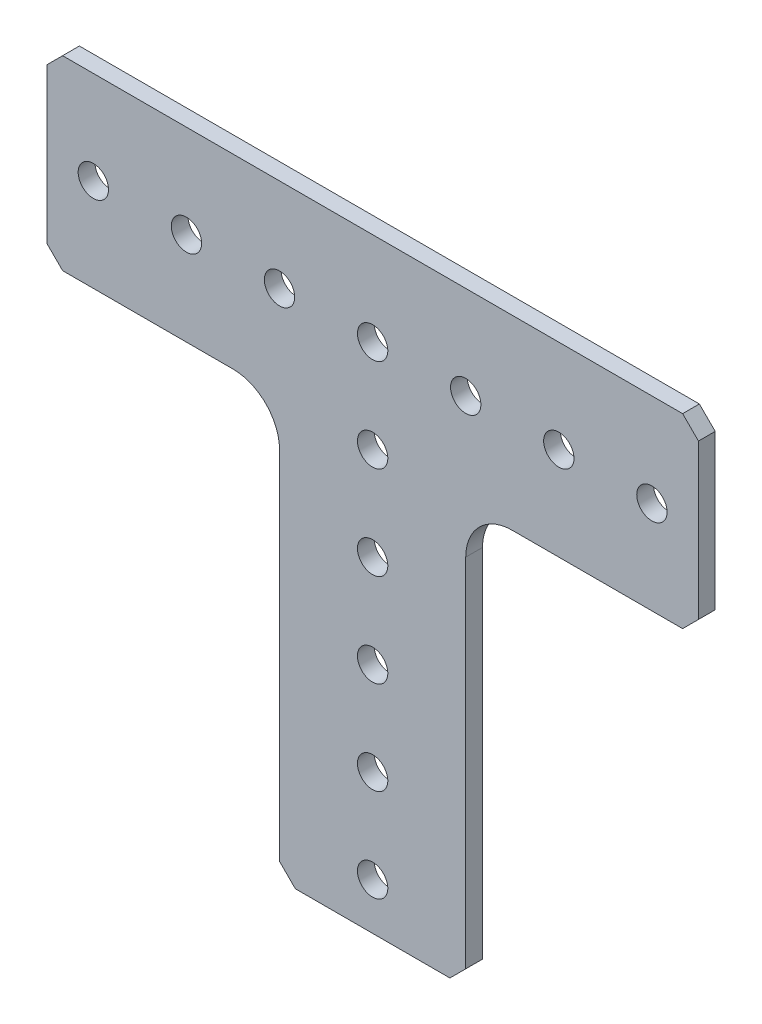
ISO-10303-21;
HEADER;
FILE_DESCRIPTION(('STEP AP214'),'2;1');
FILE_NAME('part.step','',(''),(''),'','','');
FILE_SCHEMA(('AUTOMOTIVE_DESIGN { 1 0 10303 214 1 1 1 1 }'));
ENDSEC;
DATA;
#1=APPLICATION_CONTEXT('core data for automotive mechanical design processes');
#2=APPLICATION_PROTOCOL_DEFINITION('international standard','automotive_design',2000,#1);
#3=PRODUCT_CONTEXT('',#1,'mechanical');
#4=PRODUCT('Part','Part','',(#3));
#5=PRODUCT_RELATED_PRODUCT_CATEGORY('part','',(#4));
#6=PRODUCT_DEFINITION_FORMATION('','',#4);
#7=PRODUCT_DEFINITION_CONTEXT('part definition',#1,'design');
#8=PRODUCT_DEFINITION('design','',#6,#7);
#9=PRODUCT_DEFINITION_SHAPE('','',#8);
#10=(LENGTH_UNIT() NAMED_UNIT(*) SI_UNIT(.MILLI.,.METRE.));
#11=(NAMED_UNIT(*) PLANE_ANGLE_UNIT() SI_UNIT($,.RADIAN.));
#12=(NAMED_UNIT(*) SI_UNIT($,.STERADIAN.) SOLID_ANGLE_UNIT());
#13=UNCERTAINTY_MEASURE_WITH_UNIT(LENGTH_MEASURE(1.E-05),#10,'distance_accuracy_value','');
#14=(GEOMETRIC_REPRESENTATION_CONTEXT(3) GLOBAL_UNCERTAINTY_ASSIGNED_CONTEXT((#13)) GLOBAL_UNIT_ASSIGNED_CONTEXT((#10,
#11,#12)) REPRESENTATION_CONTEXT('',''));
#15=CARTESIAN_POINT('',(0.,0.,0.));
#16=DIRECTION('',(0.,0.,1.));
#17=DIRECTION('',(1.,0.,0.));
#18=AXIS2_PLACEMENT_3D('',#15,#16,#17);
#19=CARTESIAN_POINT('',(44.45,-57.15,2.286));
#20=DIRECTION('',(0.,0.,1.));
#21=DIRECTION('',(1.,0.,0.));
#22=AXIS2_PLACEMENT_3D('',#19,#20,#21);
#23=PLANE('',#22);
#24=CARTESIAN_POINT('',(0.,-38.1,2.286));
#25=DIRECTION('',(0.,0.,-1.));
#26=DIRECTION('',(-1.,0.,0.));
#27=AXIS2_PLACEMENT_3D('',#24,#25,#26);
#28=CIRCLE('',#27,2.0701);
#29=CARTESIAN_POINT('',(-2.0701,-38.1,2.286));
#30=VERTEX_POINT('',#29);
#31=EDGE_CURVE('E221',#30,#30,#28,.T.);
#32=ORIENTED_EDGE('',*,*,#31,.T.);
#33=EDGE_LOOP('',(#32));
#34=FACE_BOUND('',#33,.T.);
#35=CARTESIAN_POINT('',(0.,-12.7,2.286));
#36=DIRECTION('',(0.,0.,-1.));
#37=DIRECTION('',(-1.,0.,0.));
#38=AXIS2_PLACEMENT_3D('',#35,#36,#37);
#39=CIRCLE('',#38,2.0701);
#40=CARTESIAN_POINT('',(-2.0701,-12.7,2.286));
#41=VERTEX_POINT('',#40);
#42=EDGE_CURVE('E320',#41,#41,#39,.T.);
#43=ORIENTED_EDGE('',*,*,#42,.T.);
#44=EDGE_LOOP('',(#43));
#45=FACE_BOUND('',#44,.T.);
#46=CARTESIAN_POINT('',(38.1,12.7,2.286));
#47=DIRECTION('',(0.,0.,-1.));
#48=DIRECTION('',(-1.,0.,0.));
#49=AXIS2_PLACEMENT_3D('',#46,#47,#48);
#50=CIRCLE('',#49,2.0701);
#51=CARTESIAN_POINT('',(36.0299,12.7,2.286));
#52=VERTEX_POINT('',#51);
#53=EDGE_CURVE('E323',#52,#52,#50,.T.);
#54=ORIENTED_EDGE('',*,*,#53,.T.);
#55=EDGE_LOOP('',(#54));
#56=FACE_BOUND('',#55,.T.);
#57=CARTESIAN_POINT('',(12.7,12.7,2.286));
#58=DIRECTION('',(0.,0.,-1.));
#59=DIRECTION('',(-1.,0.,0.));
#60=AXIS2_PLACEMENT_3D('',#57,#58,#59);
#61=CIRCLE('',#60,2.0701);
#62=CARTESIAN_POINT('',(10.6299,12.7,2.286));
#63=VERTEX_POINT('',#62);
#64=EDGE_CURVE('E326',#63,#63,#61,.T.);
#65=ORIENTED_EDGE('',*,*,#64,.T.);
#66=EDGE_LOOP('',(#65));
#67=FACE_BOUND('',#66,.T.);
#68=CARTESIAN_POINT('',(-12.7,12.7,2.286));
#69=DIRECTION('',(0.,0.,-1.));
#70=DIRECTION('',(-1.,0.,0.));
#71=AXIS2_PLACEMENT_3D('',#68,#69,#70);
#72=CIRCLE('',#71,2.0701);
#73=CARTESIAN_POINT('',(-14.7701,12.7,2.286));
#74=VERTEX_POINT('',#73);
#75=EDGE_CURVE('E329',#74,#74,#72,.T.);
#76=ORIENTED_EDGE('',*,*,#75,.T.);
#77=EDGE_LOOP('',(#76));
#78=FACE_BOUND('',#77,.T.);
#79=CARTESIAN_POINT('',(-38.1,12.7,2.286));
#80=DIRECTION('',(0.,0.,-1.));
#81=DIRECTION('',(-1.,0.,0.));
#82=AXIS2_PLACEMENT_3D('',#79,#80,#81);
#83=CIRCLE('',#82,2.0701);
#84=CARTESIAN_POINT('',(-40.1701,12.7,2.286));
#85=VERTEX_POINT('',#84);
#86=EDGE_CURVE('E332',#85,#85,#83,.T.);
#87=ORIENTED_EDGE('',*,*,#86,.T.);
#88=EDGE_LOOP('',(#87));
#89=FACE_BOUND('',#88,.T.);
#90=CARTESIAN_POINT('',(-25.4,12.7,2.286));
#91=DIRECTION('',(0.,0.,-1.));
#92=DIRECTION('',(-1.,0.,0.));
#93=AXIS2_PLACEMENT_3D('',#90,#91,#92);
#94=CIRCLE('',#93,2.0701);
#95=CARTESIAN_POINT('',(-27.4701,12.7,2.286));
#96=VERTEX_POINT('',#95);
#97=EDGE_CURVE('E335',#96,#96,#94,.T.);
#98=ORIENTED_EDGE('',*,*,#97,.T.);
#99=EDGE_LOOP('',(#98));
#100=FACE_BOUND('',#99,.T.);
#101=CARTESIAN_POINT('',(0.,12.7,2.286));
#102=DIRECTION('',(0.,0.,-1.));
#103=DIRECTION('',(-1.,0.,0.));
#104=AXIS2_PLACEMENT_3D('',#101,#102,#103);
#105=CIRCLE('',#104,2.0701);
#106=CARTESIAN_POINT('',(-2.0701,12.7,2.286));
#107=VERTEX_POINT('',#106);
#108=EDGE_CURVE('E338',#107,#107,#105,.T.);
#109=ORIENTED_EDGE('',*,*,#108,.T.);
#110=EDGE_LOOP('',(#109));
#111=FACE_BOUND('',#110,.T.);
#112=CARTESIAN_POINT('',(25.4,12.7,2.286));
#113=DIRECTION('',(0.,0.,-1.));
#114=DIRECTION('',(-1.,0.,0.));
#115=AXIS2_PLACEMENT_3D('',#112,#113,#114);
#116=CIRCLE('',#115,2.0701);
#117=CARTESIAN_POINT('',(23.3299,12.7,2.286));
#118=VERTEX_POINT('',#117);
#119=EDGE_CURVE('E341',#118,#118,#116,.T.);
#120=ORIENTED_EDGE('',*,*,#119,.T.);
#121=EDGE_LOOP('',(#120));
#122=FACE_BOUND('',#121,.T.);
#123=CARTESIAN_POINT('',(0.,0.,2.286));
#124=DIRECTION('',(0.,0.,-1.));
#125=DIRECTION('',(-1.,0.,0.));
#126=AXIS2_PLACEMENT_3D('',#123,#124,#125);
#127=CIRCLE('',#126,2.0701);
#128=CARTESIAN_POINT('',(-2.0701,0.,2.286));
#129=VERTEX_POINT('',#128);
#130=EDGE_CURVE('E344',#129,#129,#127,.T.);
#131=ORIENTED_EDGE('',*,*,#130,.T.);
#132=EDGE_LOOP('',(#131));
#133=FACE_BOUND('',#132,.T.);
#134=CARTESIAN_POINT('',(0.,-25.4,2.286));
#135=DIRECTION('',(0.,0.,-1.));
#136=DIRECTION('',(-1.,0.,0.));
#137=AXIS2_PLACEMENT_3D('',#134,#135,#136);
#138=CIRCLE('',#137,2.0701);
#139=CARTESIAN_POINT('',(-2.0701,-25.4,2.286));
#140=VERTEX_POINT('',#139);
#141=EDGE_CURVE('E346',#140,#140,#138,.T.);
#142=ORIENTED_EDGE('',*,*,#141,.T.);
#143=EDGE_LOOP('',(#142));
#144=FACE_BOUND('',#143,.T.);
#145=CARTESIAN_POINT('',(0.,-50.8,2.286));
#146=DIRECTION('',(0.,0.,-1.));
#147=DIRECTION('',(-1.,0.,0.));
#148=AXIS2_PLACEMENT_3D('',#145,#146,#147);
#149=CIRCLE('',#148,2.0701);
#150=CARTESIAN_POINT('',(-2.07009999999999,-50.8,2.286));
#151=VERTEX_POINT('',#150);
#152=EDGE_CURVE('E19',#151,#151,#149,.T.);
#153=ORIENTED_EDGE('',*,*,#152,.T.);
#154=EDGE_LOOP('',(#153));
#155=FACE_BOUND('',#154,.T.);
#156=DIRECTION('',(0.,1.,0.));
#157=VECTOR('',#156,1.);
#158=CARTESIAN_POINT('',(12.7,0.,2.286));
#159=LINE('',#158,#157);
#160=CARTESIAN_POINT('',(12.7,-54.991,2.286));
#161=VERTEX_POINT('',#160);
#162=CARTESIAN_POINT('',(12.7,-6.34999999999998,2.286));
#163=VERTEX_POINT('',#162);
#164=EDGE_CURVE('E239',#161,#163,#159,.T.);
#165=ORIENTED_EDGE('',*,*,#164,.T.);
#166=CARTESIAN_POINT('',(19.05,-6.34999999999998,2.286));
#167=DIRECTION('',(0.,0.,1.));
#168=DIRECTION('',(1.,0.,0.));
#169=AXIS2_PLACEMENT_3D('',#166,#167,#168);
#170=CIRCLE('',#169,6.35000000000001);
#171=CARTESIAN_POINT('',(19.05,0.,2.286));
#172=VERTEX_POINT('',#171);
#173=EDGE_CURVE('E316',#163,#172,#170,.F.);
#174=ORIENTED_EDGE('',*,*,#173,.T.);
#175=DIRECTION('',(-1.,0.,0.));
#176=VECTOR('',#175,1.);
#177=CARTESIAN_POINT('',(0.,0.,2.286));
#178=LINE('',#177,#176);
#179=CARTESIAN_POINT('',(42.291,0.,2.286));
#180=VERTEX_POINT('',#179);
#181=EDGE_CURVE('E230',#172,#180,#178,.F.);
#182=ORIENTED_EDGE('',*,*,#181,.T.);
#183=DIRECTION('',(-0.707106781186547,-0.707106781186548,0.));
#184=VECTOR('',#183,1.);
#185=CARTESIAN_POINT('',(44.45,2.15900000000001,2.286));
#186=LINE('',#185,#184);
#187=CARTESIAN_POINT('',(44.45,2.15900000000002,2.286));
#188=VERTEX_POINT('',#187);
#189=EDGE_CURVE('E215',#180,#188,#186,.F.);
#190=ORIENTED_EDGE('',*,*,#189,.T.);
#191=DIRECTION('',(0.,1.,0.));
#192=VECTOR('',#191,1.);
#193=CARTESIAN_POINT('',(44.45,25.4,2.286));
#194=LINE('',#193,#192);
#195=CARTESIAN_POINT('',(44.45,23.241,2.286));
#196=VERTEX_POINT('',#195);
#197=EDGE_CURVE('E224',#188,#196,#194,.T.);
#198=ORIENTED_EDGE('',*,*,#197,.T.);
#199=DIRECTION('',(0.707106781186546,-0.707106781186549,0.));
#200=VECTOR('',#199,1.);
#201=CARTESIAN_POINT('',(42.291,25.4,2.286));
#202=LINE('',#201,#200);
#203=CARTESIAN_POINT('',(42.291,25.4,2.286));
#204=VERTEX_POINT('',#203);
#205=EDGE_CURVE('E204',#196,#204,#202,.F.);
#206=ORIENTED_EDGE('',*,*,#205,.T.);
#207=DIRECTION('',(1.,0.,0.));
#208=VECTOR('',#207,1.);
#209=CARTESIAN_POINT('',(-44.45,25.4,2.286));
#210=LINE('',#209,#208);
#211=CARTESIAN_POINT('',(-42.291,25.4,2.286));
#212=VERTEX_POINT('',#211);
#213=EDGE_CURVE('E193',#204,#212,#210,.F.);
#214=ORIENTED_EDGE('',*,*,#213,.T.);
#215=DIRECTION('',(0.707106781186548,0.707106781186548,0.));
#216=VECTOR('',#215,1.);
#217=CARTESIAN_POINT('',(-44.45,23.241,2.286));
#218=LINE('',#217,#216);
#219=CARTESIAN_POINT('',(-44.45,23.241,2.286));
#220=VERTEX_POINT('',#219);
#221=EDGE_CURVE('E182',#212,#220,#218,.F.);
#222=ORIENTED_EDGE('',*,*,#221,.T.);
#223=DIRECTION('',(0.,1.,0.));
#224=VECTOR('',#223,1.);
#225=CARTESIAN_POINT('',(-44.45,25.4,2.286));
#226=LINE('',#225,#224);
#227=CARTESIAN_POINT('',(-44.45,2.15899999999999,2.286));
#228=VERTEX_POINT('',#227);
#229=EDGE_CURVE('E181',#220,#228,#226,.F.);
#230=ORIENTED_EDGE('',*,*,#229,.T.);
#231=DIRECTION('',(0.707106781186547,-0.707106781186548,0.));
#232=VECTOR('',#231,1.);
#233=CARTESIAN_POINT('',(-42.291,0.,2.286));
#234=LINE('',#233,#232);
#235=CARTESIAN_POINT('',(-42.291,0.,2.286));
#236=VERTEX_POINT('',#235);
#237=EDGE_CURVE('E170',#236,#228,#234,.F.);
#238=ORIENTED_EDGE('',*,*,#237,.F.);
#239=DIRECTION('',(1.,0.,0.));
#240=VECTOR('',#239,1.);
#241=CARTESIAN_POINT('',(0.,0.,2.286));
#242=LINE('',#241,#240);
#243=CARTESIAN_POINT('',(-19.05,0.,2.286));
#244=VERTEX_POINT('',#243);
#245=EDGE_CURVE('E126',#244,#236,#242,.F.);
#246=ORIENTED_EDGE('',*,*,#245,.F.);
#247=CARTESIAN_POINT('',(-19.05,-6.34999999999999,2.286));
#248=DIRECTION('',(0.,0.,1.));
#249=DIRECTION('',(1.,0.,0.));
#250=AXIS2_PLACEMENT_3D('',#247,#248,#249);
#251=CIRCLE('',#250,6.35000000000001);
#252=CARTESIAN_POINT('',(-12.7,-6.34999999999998,2.286));
#253=VERTEX_POINT('',#252);
#254=EDGE_CURVE('E139',#244,#253,#251,.F.);
#255=ORIENTED_EDGE('',*,*,#254,.T.);
#256=DIRECTION('',(0.,-1.,0.));
#257=VECTOR('',#256,1.);
#258=CARTESIAN_POINT('',(-12.7,0.,2.286));
#259=LINE('',#258,#257);
#260=CARTESIAN_POINT('',(-12.7,-54.991,2.286));
#261=VERTEX_POINT('',#260);
#262=EDGE_CURVE('E132',#261,#253,#259,.F.);
#263=ORIENTED_EDGE('',*,*,#262,.F.);
#264=DIRECTION('',(0.707106781186547,-0.707106781186548,0.));
#265=VECTOR('',#264,1.);
#266=CARTESIAN_POINT('',(-10.541,-57.15,2.286));
#267=LINE('',#266,#265);
#268=CARTESIAN_POINT('',(-10.541,-57.15,2.286));
#269=VERTEX_POINT('',#268);
#270=EDGE_CURVE('E149',#269,#261,#267,.F.);
#271=ORIENTED_EDGE('',*,*,#270,.F.);
#272=DIRECTION('',(1.,0.,0.));
#273=VECTOR('',#272,1.);
#274=CARTESIAN_POINT('',(-12.7,-57.15,2.286));
#275=LINE('',#274,#273);
#276=CARTESIAN_POINT('',(10.541,-57.15,2.286));
#277=VERTEX_POINT('',#276);
#278=EDGE_CURVE('E250',#269,#277,#275,.T.);
#279=ORIENTED_EDGE('',*,*,#278,.T.);
#280=DIRECTION('',(-0.707106781186547,-0.707106781186548,0.));
#281=VECTOR('',#280,1.);
#282=CARTESIAN_POINT('',(12.7,-54.991,2.286));
#283=LINE('',#282,#281);
#284=EDGE_CURVE('E245',#277,#161,#283,.F.);
#285=ORIENTED_EDGE('',*,*,#284,.T.);
#286=EDGE_LOOP('',(#165,#174,#182,#190,#198,#206,#214,#222,#230,#238,#246,#255,#263,#271,#279,#285));
#287=FACE_BOUND('',#286,.T.);
#288=ADVANCED_FACE('F16',(#34,#45,#56,#67,#78,#89,#100,#111,#122,#133,#144,#155,#287),#23,.T.);
#289=CARTESIAN_POINT('',(0.,-50.8,2.286));
#290=DIRECTION('',(0.,0.,-1.));
#291=DIRECTION('',(-1.,0.,0.));
#292=AXIS2_PLACEMENT_3D('',#289,#290,#291);
#293=CYLINDRICAL_SURFACE('',#292,2.0701);
#294=CARTESIAN_POINT('',(0.,-50.8,0.));
#295=DIRECTION('',(0.,0.,-1.));
#296=DIRECTION('',(-1.,0.,0.));
#297=AXIS2_PLACEMENT_3D('',#294,#295,#296);
#298=CIRCLE('',#297,2.0701);
#299=CARTESIAN_POINT('',(-2.07009999999999,-50.8,0.));
#300=VERTEX_POINT('',#299);
#301=EDGE_CURVE('E227',#300,#300,#298,.T.);
#302=ORIENTED_EDGE('',*,*,#301,.T.);
#303=EDGE_LOOP('',(#302));
#304=FACE_BOUND('',#303,.T.);
#305=ORIENTED_EDGE('',*,*,#152,.F.);
#306=EDGE_LOOP('',(#305));
#307=FACE_BOUND('',#306,.T.);
#308=ADVANCED_FACE('F354',(#304,#307),#293,.F.);
#309=CARTESIAN_POINT('',(0.,-25.4,2.286));
#310=DIRECTION('',(0.,0.,-1.));
#311=DIRECTION('',(-1.,0.,0.));
#312=AXIS2_PLACEMENT_3D('',#309,#310,#311);
#313=CYLINDRICAL_SURFACE('',#312,2.0701);
#314=CARTESIAN_POINT('',(0.,-25.4,0.));
#315=DIRECTION('',(0.,0.,-1.));
#316=DIRECTION('',(-1.,0.,0.));
#317=AXIS2_PLACEMENT_3D('',#314,#315,#316);
#318=CIRCLE('',#317,2.0701);
#319=CARTESIAN_POINT('',(-2.0701,-25.4,0.));
#320=VERTEX_POINT('',#319);
#321=EDGE_CURVE('E311',#320,#320,#318,.T.);
#322=ORIENTED_EDGE('',*,*,#321,.T.);
#323=EDGE_LOOP('',(#322));
#324=FACE_BOUND('',#323,.T.);
#325=ORIENTED_EDGE('',*,*,#141,.F.);
#326=EDGE_LOOP('',(#325));
#327=FACE_BOUND('',#326,.T.);
#328=ADVANCED_FACE('F356',(#324,#327),#313,.F.);
#329=CARTESIAN_POINT('',(0.,0.,2.286));
#330=DIRECTION('',(0.,0.,-1.));
#331=DIRECTION('',(-1.,0.,0.));
#332=AXIS2_PLACEMENT_3D('',#329,#330,#331);
#333=CYLINDRICAL_SURFACE('',#332,2.0701);
#334=CARTESIAN_POINT('',(0.,0.,0.));
#335=DIRECTION('',(0.,0.,-1.));
#336=DIRECTION('',(-1.,0.,0.));
#337=AXIS2_PLACEMENT_3D('',#334,#335,#336);
#338=CIRCLE('',#337,2.0701);
#339=CARTESIAN_POINT('',(-2.0701,0.,0.));
#340=VERTEX_POINT('',#339);
#341=EDGE_CURVE('E308',#340,#340,#338,.T.);
#342=ORIENTED_EDGE('',*,*,#341,.T.);
#343=EDGE_LOOP('',(#342));
#344=FACE_BOUND('',#343,.T.);
#345=ORIENTED_EDGE('',*,*,#130,.F.);
#346=EDGE_LOOP('',(#345));
#347=FACE_BOUND('',#346,.T.);
#348=ADVANCED_FACE('F363',(#344,#347),#333,.F.);
#349=CARTESIAN_POINT('',(25.4,12.7,2.286));
#350=DIRECTION('',(0.,0.,-1.));
#351=DIRECTION('',(-1.,0.,0.));
#352=AXIS2_PLACEMENT_3D('',#349,#350,#351);
#353=CYLINDRICAL_SURFACE('',#352,2.0701);
#354=CARTESIAN_POINT('',(25.4,12.7,0.));
#355=DIRECTION('',(0.,0.,-1.));
#356=DIRECTION('',(-1.,0.,0.));
#357=AXIS2_PLACEMENT_3D('',#354,#355,#356);
#358=CIRCLE('',#357,2.0701);
#359=CARTESIAN_POINT('',(23.3299,12.7,0.));
#360=VERTEX_POINT('',#359);
#361=EDGE_CURVE('E305',#360,#360,#358,.T.);
#362=ORIENTED_EDGE('',*,*,#361,.T.);
#363=EDGE_LOOP('',(#362));
#364=FACE_BOUND('',#363,.T.);
#365=ORIENTED_EDGE('',*,*,#119,.F.);
#366=EDGE_LOOP('',(#365));
#367=FACE_BOUND('',#366,.T.);
#368=ADVANCED_FACE('F466',(#364,#367),#353,.F.);
#369=CARTESIAN_POINT('',(0.,12.7,2.286));
#370=DIRECTION('',(0.,0.,-1.));
#371=DIRECTION('',(-1.,0.,0.));
#372=AXIS2_PLACEMENT_3D('',#369,#370,#371);
#373=CYLINDRICAL_SURFACE('',#372,2.0701);
#374=CARTESIAN_POINT('',(0.,12.7,0.));
#375=DIRECTION('',(0.,0.,-1.));
#376=DIRECTION('',(-1.,0.,0.));
#377=AXIS2_PLACEMENT_3D('',#374,#375,#376);
#378=CIRCLE('',#377,2.0701);
#379=CARTESIAN_POINT('',(-2.0701,12.7,0.));
#380=VERTEX_POINT('',#379);
#381=EDGE_CURVE('E302',#380,#380,#378,.T.);
#382=ORIENTED_EDGE('',*,*,#381,.T.);
#383=EDGE_LOOP('',(#382));
#384=FACE_BOUND('',#383,.T.);
#385=ORIENTED_EDGE('',*,*,#108,.F.);
#386=EDGE_LOOP('',(#385));
#387=FACE_BOUND('',#386,.T.);
#388=ADVANCED_FACE('F462',(#384,#387),#373,.F.);
#389=CARTESIAN_POINT('',(-25.4,12.7,2.286));
#390=DIRECTION('',(0.,0.,-1.));
#391=DIRECTION('',(-1.,0.,0.));
#392=AXIS2_PLACEMENT_3D('',#389,#390,#391);
#393=CYLINDRICAL_SURFACE('',#392,2.0701);
#394=CARTESIAN_POINT('',(-25.4,12.7,0.));
#395=DIRECTION('',(0.,0.,-1.));
#396=DIRECTION('',(-1.,0.,0.));
#397=AXIS2_PLACEMENT_3D('',#394,#395,#396);
#398=CIRCLE('',#397,2.0701);
#399=CARTESIAN_POINT('',(-27.4701,12.7,0.));
#400=VERTEX_POINT('',#399);
#401=EDGE_CURVE('E299',#400,#400,#398,.T.);
#402=ORIENTED_EDGE('',*,*,#401,.T.);
#403=EDGE_LOOP('',(#402));
#404=FACE_BOUND('',#403,.T.);
#405=ORIENTED_EDGE('',*,*,#97,.F.);
#406=EDGE_LOOP('',(#405));
#407=FACE_BOUND('',#406,.T.);
#408=ADVANCED_FACE('F458',(#404,#407),#393,.F.);
#409=CARTESIAN_POINT('',(-38.1,12.7,2.286));
#410=DIRECTION('',(0.,0.,-1.));
#411=DIRECTION('',(-1.,0.,0.));
#412=AXIS2_PLACEMENT_3D('',#409,#410,#411);
#413=CYLINDRICAL_SURFACE('',#412,2.0701);
#414=CARTESIAN_POINT('',(-38.1,12.7,0.));
#415=DIRECTION('',(0.,0.,-1.));
#416=DIRECTION('',(-1.,0.,0.));
#417=AXIS2_PLACEMENT_3D('',#414,#415,#416);
#418=CIRCLE('',#417,2.0701);
#419=CARTESIAN_POINT('',(-40.1701,12.7,0.));
#420=VERTEX_POINT('',#419);
#421=EDGE_CURVE('E296',#420,#420,#418,.T.);
#422=ORIENTED_EDGE('',*,*,#421,.T.);
#423=EDGE_LOOP('',(#422));
#424=FACE_BOUND('',#423,.T.);
#425=ORIENTED_EDGE('',*,*,#86,.F.);
#426=EDGE_LOOP('',(#425));
#427=FACE_BOUND('',#426,.T.);
#428=ADVANCED_FACE('F454',(#424,#427),#413,.F.);
#429=CARTESIAN_POINT('',(-12.7,12.7,2.286));
#430=DIRECTION('',(0.,0.,-1.));
#431=DIRECTION('',(-1.,0.,0.));
#432=AXIS2_PLACEMENT_3D('',#429,#430,#431);
#433=CYLINDRICAL_SURFACE('',#432,2.0701);
#434=CARTESIAN_POINT('',(-12.7,12.7,0.));
#435=DIRECTION('',(0.,0.,-1.));
#436=DIRECTION('',(-1.,0.,0.));
#437=AXIS2_PLACEMENT_3D('',#434,#435,#436);
#438=CIRCLE('',#437,2.0701);
#439=CARTESIAN_POINT('',(-14.7701,12.7,0.));
#440=VERTEX_POINT('',#439);
#441=EDGE_CURVE('E293',#440,#440,#438,.T.);
#442=ORIENTED_EDGE('',*,*,#441,.T.);
#443=EDGE_LOOP('',(#442));
#444=FACE_BOUND('',#443,.T.);
#445=ORIENTED_EDGE('',*,*,#75,.F.);
#446=EDGE_LOOP('',(#445));
#447=FACE_BOUND('',#446,.T.);
#448=ADVANCED_FACE('F450',(#444,#447),#433,.F.);
#449=CARTESIAN_POINT('',(12.7,12.7,2.286));
#450=DIRECTION('',(0.,0.,-1.));
#451=DIRECTION('',(-1.,0.,0.));
#452=AXIS2_PLACEMENT_3D('',#449,#450,#451);
#453=CYLINDRICAL_SURFACE('',#452,2.0701);
#454=CARTESIAN_POINT('',(12.7,12.7,0.));
#455=DIRECTION('',(0.,0.,-1.));
#456=DIRECTION('',(-1.,0.,0.));
#457=AXIS2_PLACEMENT_3D('',#454,#455,#456);
#458=CIRCLE('',#457,2.0701);
#459=CARTESIAN_POINT('',(10.6299,12.7,0.));
#460=VERTEX_POINT('',#459);
#461=EDGE_CURVE('E290',#460,#460,#458,.T.);
#462=ORIENTED_EDGE('',*,*,#461,.T.);
#463=EDGE_LOOP('',(#462));
#464=FACE_BOUND('',#463,.T.);
#465=ORIENTED_EDGE('',*,*,#64,.F.);
#466=EDGE_LOOP('',(#465));
#467=FACE_BOUND('',#466,.T.);
#468=ADVANCED_FACE('F446',(#464,#467),#453,.F.);
#469=CARTESIAN_POINT('',(38.1,12.7,2.286));
#470=DIRECTION('',(0.,0.,-1.));
#471=DIRECTION('',(-1.,0.,0.));
#472=AXIS2_PLACEMENT_3D('',#469,#470,#471);
#473=CYLINDRICAL_SURFACE('',#472,2.0701);
#474=CARTESIAN_POINT('',(38.1,12.7,0.));
#475=DIRECTION('',(0.,0.,-1.));
#476=DIRECTION('',(-1.,0.,0.));
#477=AXIS2_PLACEMENT_3D('',#474,#475,#476);
#478=CIRCLE('',#477,2.0701);
#479=CARTESIAN_POINT('',(36.0299,12.7,0.));
#480=VERTEX_POINT('',#479);
#481=EDGE_CURVE('E287',#480,#480,#478,.T.);
#482=ORIENTED_EDGE('',*,*,#481,.T.);
#483=EDGE_LOOP('',(#482));
#484=FACE_BOUND('',#483,.T.);
#485=ORIENTED_EDGE('',*,*,#53,.F.);
#486=EDGE_LOOP('',(#485));
#487=FACE_BOUND('',#486,.T.);
#488=ADVANCED_FACE('F442',(#484,#487),#473,.F.);
#489=CARTESIAN_POINT('',(0.,-12.7,2.286));
#490=DIRECTION('',(0.,0.,-1.));
#491=DIRECTION('',(-1.,0.,0.));
#492=AXIS2_PLACEMENT_3D('',#489,#490,#491);
#493=CYLINDRICAL_SURFACE('',#492,2.0701);
#494=CARTESIAN_POINT('',(0.,-12.7,0.));
#495=DIRECTION('',(0.,0.,-1.));
#496=DIRECTION('',(-1.,0.,0.));
#497=AXIS2_PLACEMENT_3D('',#494,#495,#496);
#498=CIRCLE('',#497,2.0701);
#499=CARTESIAN_POINT('',(-2.0701,-12.7,0.));
#500=VERTEX_POINT('',#499);
#501=EDGE_CURVE('E284',#500,#500,#498,.T.);
#502=ORIENTED_EDGE('',*,*,#501,.T.);
#503=EDGE_LOOP('',(#502));
#504=FACE_BOUND('',#503,.T.);
#505=ORIENTED_EDGE('',*,*,#42,.F.);
#506=EDGE_LOOP('',(#505));
#507=FACE_BOUND('',#506,.T.);
#508=ADVANCED_FACE('F438',(#504,#507),#493,.F.);
#509=CARTESIAN_POINT('',(0.,-38.1,2.286));
#510=DIRECTION('',(0.,0.,-1.));
#511=DIRECTION('',(-1.,0.,0.));
#512=AXIS2_PLACEMENT_3D('',#509,#510,#511);
#513=CYLINDRICAL_SURFACE('',#512,2.0701);
#514=CARTESIAN_POINT('',(0.,-38.1,0.));
#515=DIRECTION('',(0.,0.,-1.));
#516=DIRECTION('',(-1.,0.,0.));
#517=AXIS2_PLACEMENT_3D('',#514,#515,#516);
#518=CIRCLE('',#517,2.0701);
#519=CARTESIAN_POINT('',(-2.0701,-38.1,0.));
#520=VERTEX_POINT('',#519);
#521=EDGE_CURVE('E209',#520,#520,#518,.T.);
#522=ORIENTED_EDGE('',*,*,#521,.T.);
#523=EDGE_LOOP('',(#522));
#524=FACE_BOUND('',#523,.T.);
#525=ORIENTED_EDGE('',*,*,#31,.F.);
#526=EDGE_LOOP('',(#525));
#527=FACE_BOUND('',#526,.T.);
#528=ADVANCED_FACE('F434',(#524,#527),#513,.F.);
#529=CARTESIAN_POINT('',(42.291,25.4,2.286));
#530=DIRECTION('',(-0.707106781186549,-0.707106781186546,0.));
#531=DIRECTION('',(0.707106781186546,-0.707106781186549,0.));
#532=AXIS2_PLACEMENT_3D('',#529,#530,#531);
#533=PLANE('',#532);
#534=DIRECTION('',(0.,0.,1.));
#535=VECTOR('',#534,1.);
#536=CARTESIAN_POINT('',(44.45,23.241,2.286));
#537=LINE('',#536,#535);
#538=CARTESIAN_POINT('',(44.45,23.241,0.));
#539=VERTEX_POINT('',#538);
#540=EDGE_CURVE('E212',#196,#539,#537,.F.);
#541=ORIENTED_EDGE('',*,*,#540,.T.);
#542=DIRECTION('',(-0.707106781186551,0.707106781186544,0.));
#543=VECTOR('',#542,1.);
#544=CARTESIAN_POINT('',(44.45,23.241,0.));
#545=LINE('',#544,#543);
#546=CARTESIAN_POINT('',(42.291,25.4,0.));
#547=VERTEX_POINT('',#546);
#548=EDGE_CURVE('E198',#539,#547,#545,.T.);
#549=ORIENTED_EDGE('',*,*,#548,.T.);
#550=DIRECTION('',(0.,0.,-1.));
#551=VECTOR('',#550,1.);
#552=CARTESIAN_POINT('',(42.291,25.4,2.286));
#553=LINE('',#552,#551);
#554=EDGE_CURVE('E201',#547,#204,#553,.F.);
#555=ORIENTED_EDGE('',*,*,#554,.T.);
#556=ORIENTED_EDGE('',*,*,#205,.F.);
#557=EDGE_LOOP('',(#541,#549,#555,#556));
#558=FACE_BOUND('',#557,.T.);
#559=ADVANCED_FACE('F430',(#558),#533,.F.);
#560=CARTESIAN_POINT('',(-44.45,25.4,2.286));
#561=DIRECTION('',(0.,-1.,0.));
#562=DIRECTION('',(0.,0.,-1.));
#563=AXIS2_PLACEMENT_3D('',#560,#561,#562);
#564=PLANE('',#563);
#565=DIRECTION('',(0.,0.,1.));
#566=VECTOR('',#565,1.);
#567=CARTESIAN_POINT('',(-42.291,25.4,2.286));
#568=LINE('',#567,#566);
#569=CARTESIAN_POINT('',(-42.291,25.4,0.));
#570=VERTEX_POINT('',#569);
#571=EDGE_CURVE('E190',#570,#212,#568,.T.);
#572=ORIENTED_EDGE('',*,*,#571,.T.);
#573=ORIENTED_EDGE('',*,*,#213,.F.);
#574=ORIENTED_EDGE('',*,*,#554,.F.);
#575=DIRECTION('',(1.,0.,0.));
#576=VECTOR('',#575,1.);
#577=CARTESIAN_POINT('',(44.45,25.4,0.));
#578=LINE('',#577,#576);
#579=EDGE_CURVE('E187',#547,#570,#578,.F.);
#580=ORIENTED_EDGE('',*,*,#579,.T.);
#581=EDGE_LOOP('',(#572,#573,#574,#580));
#582=FACE_BOUND('',#581,.T.);
#583=ADVANCED_FACE('F426',(#582),#564,.F.);
#584=CARTESIAN_POINT('',(-44.45,23.241,2.286));
#585=DIRECTION('',(0.707106781186548,-0.707106781186548,0.));
#586=DIRECTION('',(0.707106781186548,0.707106781186548,0.));
#587=AXIS2_PLACEMENT_3D('',#584,#585,#586);
#588=PLANE('',#587);
#589=ORIENTED_EDGE('',*,*,#571,.F.);
#590=DIRECTION('',(-0.707106781186548,-0.707106781186548,0.));
#591=VECTOR('',#590,1.);
#592=CARTESIAN_POINT('',(-42.291,25.4,0.));
#593=LINE('',#592,#591);
#594=CARTESIAN_POINT('',(-44.45,23.241,0.));
#595=VERTEX_POINT('',#594);
#596=EDGE_CURVE('E175',#570,#595,#593,.T.);
#597=ORIENTED_EDGE('',*,*,#596,.T.);
#598=DIRECTION('',(0.,0.,-1.));
#599=VECTOR('',#598,1.);
#600=CARTESIAN_POINT('',(-44.45,23.241,2.286));
#601=LINE('',#600,#599);
#602=EDGE_CURVE('E178',#595,#220,#601,.F.);
#603=ORIENTED_EDGE('',*,*,#602,.T.);
#604=ORIENTED_EDGE('',*,*,#221,.F.);
#605=EDGE_LOOP('',(#589,#597,#603,#604));
#606=FACE_BOUND('',#605,.T.);
#607=ADVANCED_FACE('F422',(#606),#588,.F.);
#608=CARTESIAN_POINT('',(-44.45,25.4,2.286));
#609=DIRECTION('',(1.,0.,0.));
#610=DIRECTION('',(0.,0.,-1.));
#611=AXIS2_PLACEMENT_3D('',#608,#609,#610);
#612=PLANE('',#611);
#613=DIRECTION('',(0.,0.,1.));
#614=VECTOR('',#613,1.);
#615=CARTESIAN_POINT('',(-44.45,2.15899999999999,0.));
#616=LINE('',#615,#614);
#617=CARTESIAN_POINT('',(-44.45,2.159,0.));
#618=VERTEX_POINT('',#617);
#619=EDGE_CURVE('E168',#228,#618,#616,.F.);
#620=ORIENTED_EDGE('',*,*,#619,.F.);
#621=ORIENTED_EDGE('',*,*,#229,.F.);
#622=ORIENTED_EDGE('',*,*,#602,.F.);
#623=DIRECTION('',(0.,1.,0.));
#624=VECTOR('',#623,1.);
#625=CARTESIAN_POINT('',(-44.45,-57.15,0.));
#626=LINE('',#625,#624);
#627=EDGE_CURVE('E165',#595,#618,#626,.F.);
#628=ORIENTED_EDGE('',*,*,#627,.T.);
#629=EDGE_LOOP('',(#620,#621,#622,#628));
#630=FACE_BOUND('',#629,.T.);
#631=ADVANCED_FACE('F418',(#630),#612,.F.);
#632=CARTESIAN_POINT('',(-42.291,0.,0.));
#633=DIRECTION('',(-0.707106781186548,-0.707106781186547,0.));
#634=DIRECTION('',(0.707106781186547,-0.707106781186548,0.));
#635=AXIS2_PLACEMENT_3D('',#632,#633,#634);
#636=PLANE('',#635);
#637=DIRECTION('',(0.707106781186546,-0.707106781186549,0.));
#638=VECTOR('',#637,1.);
#639=CARTESIAN_POINT('',(-44.45,2.159,0.));
#640=LINE('',#639,#638);
#641=CARTESIAN_POINT('',(-42.291,0.,0.));
#642=VERTEX_POINT('',#641);
#643=EDGE_CURVE('E161',#618,#642,#640,.T.);
#644=ORIENTED_EDGE('',*,*,#643,.T.);
#645=DIRECTION('',(0.,0.,1.));
#646=VECTOR('',#645,1.);
#647=CARTESIAN_POINT('',(-42.291,0.,0.));
#648=LINE('',#647,#646);
#649=EDGE_CURVE('E157',#236,#642,#648,.F.);
#650=ORIENTED_EDGE('',*,*,#649,.F.);
#651=ORIENTED_EDGE('',*,*,#237,.T.);
#652=ORIENTED_EDGE('',*,*,#619,.T.);
#653=EDGE_LOOP('',(#644,#650,#651,#652));
#654=FACE_BOUND('',#653,.T.);
#655=ADVANCED_FACE('F414',(#654),#636,.T.);
#656=CARTESIAN_POINT('',(0.,0.,0.));
#657=DIRECTION('',(0.,-1.,0.));
#658=DIRECTION('',(1.,0.,0.));
#659=AXIS2_PLACEMENT_3D('',#656,#657,#658);
#660=PLANE('',#659);
#661=DIRECTION('',(1.,0.,0.));
#662=VECTOR('',#661,1.);
#663=CARTESIAN_POINT('',(44.45,0.,0.));
#664=LINE('',#663,#662);
#665=CARTESIAN_POINT('',(-19.05,0.,0.));
#666=VERTEX_POINT('',#665);
#667=EDGE_CURVE('E164',#642,#666,#664,.T.);
#668=ORIENTED_EDGE('',*,*,#667,.T.);
#669=DIRECTION('',(0.,0.,1.));
#670=VECTOR('',#669,1.);
#671=CARTESIAN_POINT('',(-19.05,0.,0.));
#672=LINE('',#671,#670);
#673=EDGE_CURVE('E143',#666,#244,#672,.T.);
#674=ORIENTED_EDGE('',*,*,#673,.T.);
#675=ORIENTED_EDGE('',*,*,#245,.T.);
#676=ORIENTED_EDGE('',*,*,#649,.T.);
#677=EDGE_LOOP('',(#668,#674,#675,#676));
#678=FACE_BOUND('',#677,.T.);
#679=ADVANCED_FACE('F411',(#678),#660,.T.);
#680=CARTESIAN_POINT('',(-19.05,-6.34999999999999,0.));
#681=DIRECTION('',(0.,0.,1.));
#682=DIRECTION('',(1.,0.,0.));
#683=AXIS2_PLACEMENT_3D('',#680,#681,#682);
#684=CYLINDRICAL_SURFACE('',#683,6.35000000000001);
#685=ORIENTED_EDGE('',*,*,#673,.F.);
#686=CARTESIAN_POINT('',(-19.05,-6.34999999999999,0.));
#687=DIRECTION('',(0.,0.,1.));
#688=DIRECTION('',(1.,0.,0.));
#689=AXIS2_PLACEMENT_3D('',#686,#687,#688);
#690=CIRCLE('',#689,6.35000000000001);
#691=CARTESIAN_POINT('',(-12.7,-6.34999999999999,0.));
#692=VERTEX_POINT('',#691);
#693=EDGE_CURVE('E148',#666,#692,#690,.F.);
#694=ORIENTED_EDGE('',*,*,#693,.T.);
#695=DIRECTION('',(0.,0.,1.));
#696=VECTOR('',#695,1.);
#697=CARTESIAN_POINT('',(-12.7,-6.34999999999999,0.));
#698=LINE('',#697,#696);
#699=EDGE_CURVE('E136',#253,#692,#698,.F.);
#700=ORIENTED_EDGE('',*,*,#699,.F.);
#701=ORIENTED_EDGE('',*,*,#254,.F.);
#702=EDGE_LOOP('',(#685,#694,#700,#701));
#703=FACE_BOUND('',#702,.T.);
#704=ADVANCED_FACE('F146',(#703),#684,.F.);
#705=CARTESIAN_POINT('',(-12.7,0.,0.));
#706=DIRECTION('',(-1.,0.,0.));
#707=DIRECTION('',(0.,-1.,0.));
#708=AXIS2_PLACEMENT_3D('',#705,#706,#707);
#709=PLANE('',#708);
#710=ORIENTED_EDGE('',*,*,#262,.T.);
#711=ORIENTED_EDGE('',*,*,#699,.T.);
#712=DIRECTION('',(0.,1.,0.));
#713=VECTOR('',#712,1.);
#714=CARTESIAN_POINT('',(-12.7,-57.15,0.));
#715=LINE('',#714,#713);
#716=CARTESIAN_POINT('',(-12.7,-54.991,0.));
#717=VERTEX_POINT('',#716);
#718=EDGE_CURVE('E281',#692,#717,#715,.F.);
#719=ORIENTED_EDGE('',*,*,#718,.T.);
#720=DIRECTION('',(0.,0.,1.));
#721=VECTOR('',#720,1.);
#722=CARTESIAN_POINT('',(-12.7,-54.991,2.286));
#723=LINE('',#722,#721);
#724=EDGE_CURVE('E138',#261,#717,#723,.F.);
#725=ORIENTED_EDGE('',*,*,#724,.F.);
#726=EDGE_LOOP('',(#710,#711,#719,#725));
#727=FACE_BOUND('',#726,.T.);
#728=ADVANCED_FACE('F133',(#727),#709,.T.);
#729=CARTESIAN_POINT('',(-10.541,-57.15,2.286));
#730=DIRECTION('',(-0.707106781186548,-0.707106781186547,0.));
#731=DIRECTION('',(0.707106781186547,-0.707106781186548,0.));
#732=AXIS2_PLACEMENT_3D('',#729,#730,#731);
#733=PLANE('',#732);
#734=DIRECTION('',(0.707106781186547,-0.707106781186547,0.));
#735=VECTOR('',#734,1.);
#736=CARTESIAN_POINT('',(-12.7,-54.991,0.));
#737=LINE('',#736,#735);
#738=CARTESIAN_POINT('',(-10.541,-57.15,0.));
#739=VERTEX_POINT('',#738);
#740=EDGE_CURVE('E747',#717,#739,#737,.T.);
#741=ORIENTED_EDGE('',*,*,#740,.T.);
#742=DIRECTION('',(0.,0.,1.));
#743=VECTOR('',#742,1.);
#744=CARTESIAN_POINT('',(-10.541,-57.15,2.286));
#745=LINE('',#744,#743);
#746=EDGE_CURVE('E252',#739,#269,#745,.T.);
#747=ORIENTED_EDGE('',*,*,#746,.T.);
#748=ORIENTED_EDGE('',*,*,#270,.T.);
#749=ORIENTED_EDGE('',*,*,#724,.T.);
#750=EDGE_LOOP('',(#741,#747,#748,#749));
#751=FACE_BOUND('',#750,.T.);
#752=ADVANCED_FACE('F402',(#751),#733,.T.);
#753=CARTESIAN_POINT('',(-12.7,-57.15,2.286));
#754=DIRECTION('',(0.,1.,0.));
#755=DIRECTION('',(0.,0.,1.));
#756=AXIS2_PLACEMENT_3D('',#753,#754,#755);
#757=PLANE('',#756);
#758=ORIENTED_EDGE('',*,*,#746,.F.);
#759=DIRECTION('',(1.,0.,0.));
#760=VECTOR('',#759,1.);
#761=CARTESIAN_POINT('',(44.45,-57.15,0.));
#762=LINE('',#761,#760);
#763=CARTESIAN_POINT('',(10.541,-57.15,0.));
#764=VERTEX_POINT('',#763);
#765=EDGE_CURVE('E738',#739,#764,#762,.T.);
#766=ORIENTED_EDGE('',*,*,#765,.T.);
#767=DIRECTION('',(0.,0.,1.));
#768=VECTOR('',#767,1.);
#769=CARTESIAN_POINT('',(10.541,-57.15,0.));
#770=LINE('',#769,#768);
#771=EDGE_CURVE('E247',#764,#277,#770,.T.);
#772=ORIENTED_EDGE('',*,*,#771,.T.);
#773=ORIENTED_EDGE('',*,*,#278,.F.);
#774=EDGE_LOOP('',(#758,#766,#772,#773));
#775=FACE_BOUND('',#774,.T.);
#776=ADVANCED_FACE('F398',(#775),#757,.F.);
#777=CARTESIAN_POINT('',(12.7,-54.991,0.));
#778=DIRECTION('',(-0.707106781186548,0.707106781186547,0.));
#779=DIRECTION('',(-0.707106781186547,-0.707106781186548,0.));
#780=AXIS2_PLACEMENT_3D('',#777,#778,#779);
#781=PLANE('',#780);
#782=ORIENTED_EDGE('',*,*,#771,.F.);
#783=DIRECTION('',(0.707106781186547,0.707106781186547,0.));
#784=VECTOR('',#783,1.);
#785=CARTESIAN_POINT('',(10.541,-57.15,0.));
#786=LINE('',#785,#784);
#787=CARTESIAN_POINT('',(12.7,-54.991,0.));
#788=VERTEX_POINT('',#787);
#789=EDGE_CURVE('E735',#764,#788,#786,.T.);
#790=ORIENTED_EDGE('',*,*,#789,.T.);
#791=DIRECTION('',(0.,0.,1.));
#792=VECTOR('',#791,1.);
#793=CARTESIAN_POINT('',(12.7,-54.991,0.));
#794=LINE('',#793,#792);
#795=EDGE_CURVE('E242',#788,#161,#794,.T.);
#796=ORIENTED_EDGE('',*,*,#795,.T.);
#797=ORIENTED_EDGE('',*,*,#284,.F.);
#798=EDGE_LOOP('',(#782,#790,#796,#797));
#799=FACE_BOUND('',#798,.T.);
#800=ADVANCED_FACE('F394',(#799),#781,.F.);
#801=CARTESIAN_POINT('',(12.7,0.,0.));
#802=DIRECTION('',(-1.,0.,0.));
#803=DIRECTION('',(0.,0.,1.));
#804=AXIS2_PLACEMENT_3D('',#801,#802,#803);
#805=PLANE('',#804);
#806=ORIENTED_EDGE('',*,*,#795,.F.);
#807=DIRECTION('',(0.,1.,0.));
#808=VECTOR('',#807,1.);
#809=CARTESIAN_POINT('',(12.7,-57.15,0.));
#810=LINE('',#809,#808);
#811=CARTESIAN_POINT('',(12.7,-6.34999999999998,0.));
#812=VERTEX_POINT('',#811);
#813=EDGE_CURVE('E279',#788,#812,#810,.T.);
#814=ORIENTED_EDGE('',*,*,#813,.T.);
#815=DIRECTION('',(0.,0.,1.));
#816=VECTOR('',#815,1.);
#817=CARTESIAN_POINT('',(12.7,-6.34999999999998,0.));
#818=LINE('',#817,#816);
#819=EDGE_CURVE('E241',#812,#163,#818,.T.);
#820=ORIENTED_EDGE('',*,*,#819,.T.);
#821=ORIENTED_EDGE('',*,*,#164,.F.);
#822=EDGE_LOOP('',(#806,#814,#820,#821));
#823=FACE_BOUND('',#822,.T.);
#824=ADVANCED_FACE('F390',(#823),#805,.F.);
#825=CARTESIAN_POINT('',(19.05,-6.34999999999998,0.));
#826=DIRECTION('',(0.,0.,1.));
#827=DIRECTION('',(1.,0.,0.));
#828=AXIS2_PLACEMENT_3D('',#825,#826,#827);
#829=CYLINDRICAL_SURFACE('',#828,6.35000000000001);
#830=ORIENTED_EDGE('',*,*,#819,.F.);
#831=CARTESIAN_POINT('',(19.05,-6.34999999999998,0.));
#832=DIRECTION('',(0.,0.,1.));
#833=DIRECTION('',(1.,0.,0.));
#834=AXIS2_PLACEMENT_3D('',#831,#832,#833);
#835=CIRCLE('',#834,6.35000000000001);
#836=CARTESIAN_POINT('',(19.05,0.,0.));
#837=VERTEX_POINT('',#836);
#838=EDGE_CURVE('E275',#812,#837,#835,.F.);
#839=ORIENTED_EDGE('',*,*,#838,.T.);
#840=DIRECTION('',(0.,0.,1.));
#841=VECTOR('',#840,1.);
#842=CARTESIAN_POINT('',(19.05,0.,0.));
#843=LINE('',#842,#841);
#844=EDGE_CURVE('E233',#837,#172,#843,.T.);
#845=ORIENTED_EDGE('',*,*,#844,.T.);
#846=ORIENTED_EDGE('',*,*,#173,.F.);
#847=EDGE_LOOP('',(#830,#839,#845,#846));
#848=FACE_BOUND('',#847,.T.);
#849=ADVANCED_FACE('F386',(#848),#829,.F.);
#850=CARTESIAN_POINT('',(0.,0.,0.));
#851=DIRECTION('',(0.,1.,0.));
#852=DIRECTION('',(-1.,0.,0.));
#853=AXIS2_PLACEMENT_3D('',#850,#851,#852);
#854=PLANE('',#853);
#855=DIRECTION('',(0.,0.,1.));
#856=VECTOR('',#855,1.);
#857=CARTESIAN_POINT('',(42.291,0.,2.286));
#858=LINE('',#857,#856);
#859=CARTESIAN_POINT('',(42.291,0.,0.));
#860=VERTEX_POINT('',#859);
#861=EDGE_CURVE('E232',#860,#180,#858,.T.);
#862=ORIENTED_EDGE('',*,*,#861,.T.);
#863=ORIENTED_EDGE('',*,*,#181,.F.);
#864=ORIENTED_EDGE('',*,*,#844,.F.);
#865=DIRECTION('',(1.,0.,0.));
#866=VECTOR('',#865,1.);
#867=CARTESIAN_POINT('',(44.45,0.,0.));
#868=LINE('',#867,#866);
#869=EDGE_CURVE('E278',#837,#860,#868,.T.);
#870=ORIENTED_EDGE('',*,*,#869,.T.);
#871=EDGE_LOOP('',(#862,#863,#864,#870));
#872=FACE_BOUND('',#871,.T.);
#873=ADVANCED_FACE('F382',(#872),#854,.F.);
#874=CARTESIAN_POINT('',(44.45,2.15900000000001,2.286));
#875=DIRECTION('',(-0.707106781186548,0.707106781186547,0.));
#876=DIRECTION('',(-0.707106781186547,-0.707106781186548,0.));
#877=AXIS2_PLACEMENT_3D('',#874,#875,#876);
#878=PLANE('',#877);
#879=ORIENTED_EDGE('',*,*,#861,.F.);
#880=DIRECTION('',(0.707106781186547,0.707106781186547,0.));
#881=VECTOR('',#880,1.);
#882=CARTESIAN_POINT('',(42.291,0.,0.));
#883=LINE('',#882,#881);
#884=CARTESIAN_POINT('',(44.45,2.15900000000002,0.));
#885=VERTEX_POINT('',#884);
#886=EDGE_CURVE('E25',#860,#885,#883,.T.);
#887=ORIENTED_EDGE('',*,*,#886,.T.);
#888=DIRECTION('',(0.,0.,1.));
#889=VECTOR('',#888,1.);
#890=CARTESIAN_POINT('',(44.45,2.15900000000001,2.286));
#891=LINE('',#890,#889);
#892=EDGE_CURVE('E33',#885,#188,#891,.T.);
#893=ORIENTED_EDGE('',*,*,#892,.T.);
#894=ORIENTED_EDGE('',*,*,#189,.F.);
#895=EDGE_LOOP('',(#879,#887,#893,#894));
#896=FACE_BOUND('',#895,.T.);
#897=ADVANCED_FACE('F375',(#896),#878,.F.);
#898=CARTESIAN_POINT('',(44.45,25.4,2.286));
#899=DIRECTION('',(-1.,0.,0.));
#900=DIRECTION('',(0.,0.,1.));
#901=AXIS2_PLACEMENT_3D('',#898,#899,#900);
#902=PLANE('',#901);
#903=ORIENTED_EDGE('',*,*,#892,.F.);
#904=DIRECTION('',(0.,1.,0.));
#905=VECTOR('',#904,1.);
#906=CARTESIAN_POINT('',(44.45,-57.15,0.));
#907=LINE('',#906,#905);
#908=EDGE_CURVE('E9',#885,#539,#907,.T.);
#909=ORIENTED_EDGE('',*,*,#908,.T.);
#910=ORIENTED_EDGE('',*,*,#540,.F.);
#911=ORIENTED_EDGE('',*,*,#197,.F.);
#912=EDGE_LOOP('',(#903,#909,#910,#911));
#913=FACE_BOUND('',#912,.T.);
#914=ADVANCED_FACE('F369',(#913),#902,.F.);
#915=CARTESIAN_POINT('',(44.45,-57.15,0.));
#916=DIRECTION('',(0.,0.,1.));
#917=DIRECTION('',(1.,0.,0.));
#918=AXIS2_PLACEMENT_3D('',#915,#916,#917);
#919=PLANE('',#918);
#920=ORIENTED_EDGE('',*,*,#886,.F.);
#921=ORIENTED_EDGE('',*,*,#869,.F.);
#922=ORIENTED_EDGE('',*,*,#838,.F.);
#923=ORIENTED_EDGE('',*,*,#813,.F.);
#924=ORIENTED_EDGE('',*,*,#789,.F.);
#925=ORIENTED_EDGE('',*,*,#765,.F.);
#926=ORIENTED_EDGE('',*,*,#740,.F.);
#927=ORIENTED_EDGE('',*,*,#718,.F.);
#928=ORIENTED_EDGE('',*,*,#693,.F.);
#929=ORIENTED_EDGE('',*,*,#667,.F.);
#930=ORIENTED_EDGE('',*,*,#643,.F.);
#931=ORIENTED_EDGE('',*,*,#627,.F.);
#932=ORIENTED_EDGE('',*,*,#596,.F.);
#933=ORIENTED_EDGE('',*,*,#579,.F.);
#934=ORIENTED_EDGE('',*,*,#548,.F.);
#935=ORIENTED_EDGE('',*,*,#908,.F.);
#936=EDGE_LOOP('',(#920,#921,#922,#923,#924,#925,#926,#927,#928,#929,#930,#931,#932,#933,#934,#935));
#937=FACE_BOUND('',#936,.T.);
#938=ORIENTED_EDGE('',*,*,#521,.F.);
#939=EDGE_LOOP('',(#938));
#940=FACE_BOUND('',#939,.T.);
#941=ORIENTED_EDGE('',*,*,#501,.F.);
#942=EDGE_LOOP('',(#941));
#943=FACE_BOUND('',#942,.T.);
#944=ORIENTED_EDGE('',*,*,#481,.F.);
#945=EDGE_LOOP('',(#944));
#946=FACE_BOUND('',#945,.T.);
#947=ORIENTED_EDGE('',*,*,#461,.F.);
#948=EDGE_LOOP('',(#947));
#949=FACE_BOUND('',#948,.T.);
#950=ORIENTED_EDGE('',*,*,#441,.F.);
#951=EDGE_LOOP('',(#950));
#952=FACE_BOUND('',#951,.T.);
#953=ORIENTED_EDGE('',*,*,#421,.F.);
#954=EDGE_LOOP('',(#953));
#955=FACE_BOUND('',#954,.T.);
#956=ORIENTED_EDGE('',*,*,#401,.F.);
#957=EDGE_LOOP('',(#956));
#958=FACE_BOUND('',#957,.T.);
#959=ORIENTED_EDGE('',*,*,#381,.F.);
#960=EDGE_LOOP('',(#959));
#961=FACE_BOUND('',#960,.T.);
#962=ORIENTED_EDGE('',*,*,#361,.F.);
#963=EDGE_LOOP('',(#962));
#964=FACE_BOUND('',#963,.T.);
#965=ORIENTED_EDGE('',*,*,#341,.F.);
#966=EDGE_LOOP('',(#965));
#967=FACE_BOUND('',#966,.T.);
#968=ORIENTED_EDGE('',*,*,#321,.F.);
#969=EDGE_LOOP('',(#968));
#970=FACE_BOUND('',#969,.T.);
#971=ORIENTED_EDGE('',*,*,#301,.F.);
#972=EDGE_LOOP('',(#971));
#973=FACE_BOUND('',#972,.T.);
#974=ADVANCED_FACE('F367',(#937,#940,#943,#946,#949,#952,#955,#958,#961,#964,#967,#970,#973),
#919,.F.);
#975=CLOSED_SHELL('',(#288,#308,#328,#348,#368,#388,#408,#428,#448,#468,#488,#508,#528,#559,
#583,#607,#631,#655,#679,#704,#728,#752,#776,#800,#824,#849,#873,#897,#914,#974));
#976=MANIFOLD_SOLID_BREP('B1',#975);
#977=ADVANCED_BREP_SHAPE_REPRESENTATION('',(#18,#976),#14);
#978=SHAPE_DEFINITION_REPRESENTATION(#9,#977);
ENDSEC;
END-ISO-10303-21;
